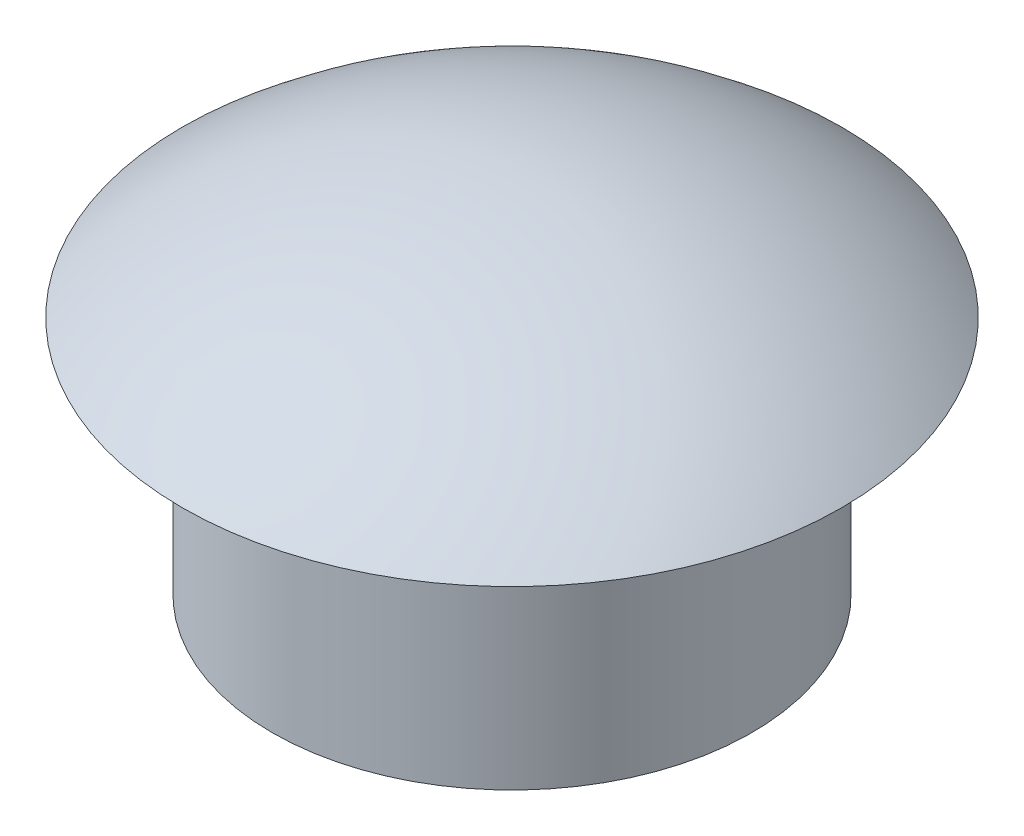
ISO-10303-21;
HEADER;
FILE_DESCRIPTION(('STEP AP214'),'2;1');
FILE_NAME('part.step','',(''),(''),'','','');
FILE_SCHEMA(('AUTOMOTIVE_DESIGN { 1 0 10303 214 1 1 1 1 }'));
ENDSEC;
DATA;
#1=APPLICATION_CONTEXT('core data for automotive mechanical design processes');
#2=APPLICATION_PROTOCOL_DEFINITION('international standard','automotive_design',2000,#1);
#3=PRODUCT_CONTEXT('',#1,'mechanical');
#4=PRODUCT('Part','Part','',(#3));
#5=PRODUCT_RELATED_PRODUCT_CATEGORY('part','',(#4));
#6=PRODUCT_DEFINITION_FORMATION('','',#4);
#7=PRODUCT_DEFINITION_CONTEXT('part definition',#1,'design');
#8=PRODUCT_DEFINITION('design','',#6,#7);
#9=PRODUCT_DEFINITION_SHAPE('','',#8);
#10=(LENGTH_UNIT() NAMED_UNIT(*) SI_UNIT(.MILLI.,.METRE.));
#11=(NAMED_UNIT(*) PLANE_ANGLE_UNIT() SI_UNIT($,.RADIAN.));
#12=(NAMED_UNIT(*) SI_UNIT($,.STERADIAN.) SOLID_ANGLE_UNIT());
#13=UNCERTAINTY_MEASURE_WITH_UNIT(LENGTH_MEASURE(1.E-05),#10,'distance_accuracy_value','');
#14=(GEOMETRIC_REPRESENTATION_CONTEXT(3) GLOBAL_UNCERTAINTY_ASSIGNED_CONTEXT((#13)) GLOBAL_UNIT_ASSIGNED_CONTEXT((#10,
#11,#12)) REPRESENTATION_CONTEXT('',''));
#15=CARTESIAN_POINT('',(0.,0.,0.));
#16=DIRECTION('',(0.,0.,1.));
#17=DIRECTION('',(1.,0.,0.));
#18=AXIS2_PLACEMENT_3D('',#15,#16,#17);
#19=CARTESIAN_POINT('',(0.,6.35,0.));
#20=DIRECTION('',(0.,1.,0.));
#21=DIRECTION('',(-1.,0.,0.));
#22=AXIS2_PLACEMENT_3D('',#19,#20,#21);
#23=PLANE('',#22);
#24=CARTESIAN_POINT('',(0.,6.35,0.));
#25=DIRECTION('',(0.,1.,0.));
#26=DIRECTION('',(-1.,0.,0.));
#27=AXIS2_PLACEMENT_3D('',#24,#25,#26);
#28=CIRCLE('',#27,4.7625);
#29=CARTESIAN_POINT('',(-4.7625,6.35,0.));
#30=VERTEX_POINT('',#29);
#31=EDGE_CURVE('E53',#30,#30,#28,.T.);
#32=ORIENTED_EDGE('',*,*,#31,.F.);
#33=EDGE_LOOP('',(#32));
#34=FACE_BOUND('',#33,.T.);
#35=CARTESIAN_POINT('',(-3.862295552,6.35,0.));
#36=DIRECTION('',(0.,1.,0.));
#37=DIRECTION('',(0.,0.,-1.));
#38=AXIS2_PLACEMENT_3D('',#35,#36,#37);
#39=CIRCLE('',#38,0.79375);
#40=CARTESIAN_POINT('',(-4.656045552,6.35,0.));
#41=VERTEX_POINT('',#40);
#42=EDGE_CURVE('E47',#41,#41,#39,.T.);
#43=ORIENTED_EDGE('',*,*,#42,.T.);
#44=EDGE_LOOP('',(#43));
#45=FACE_BOUND('',#44,.T.);
#46=CARTESIAN_POINT('',(3.862295552,6.35,0.));
#47=DIRECTION('',(0.,-1.,0.));
#48=DIRECTION('',(0.,0.,-1.));
#49=AXIS2_PLACEMENT_3D('',#46,#47,#48);
#50=CIRCLE('',#49,0.79375);
#51=CARTESIAN_POINT('',(4.656045552,6.35,0.));
#52=VERTEX_POINT('',#51);
#53=EDGE_CURVE('E10',#52,#52,#50,.T.);
#54=ORIENTED_EDGE('',*,*,#53,.F.);
#55=EDGE_LOOP('',(#54));
#56=FACE_BOUND('',#55,.T.);
#57=ADVANCED_FACE('F33',(#34,#45,#56),#23,.F.);
#58=CARTESIAN_POINT('',(0.,0.,0.));
#59=DIRECTION('',(0.,1.,0.));
#60=DIRECTION('',(0.,0.,1.));
#61=AXIS2_PLACEMENT_3D('',#58,#59,#60);
#62=PLANE('',#61);
#63=CARTESIAN_POINT('',(0.,0.,0.));
#64=DIRECTION('',(0.,1.,0.));
#65=DIRECTION('',(0.,0.,1.));
#66=AXIS2_PLACEMENT_3D('',#63,#64,#65);
#67=CIRCLE('',#66,6.35);
#68=CARTESIAN_POINT('',(0.,0.,6.35));
#69=VERTEX_POINT('',#68);
#70=EDGE_CURVE('E37',#69,#69,#67,.T.);
#71=ORIENTED_EDGE('',*,*,#70,.F.);
#72=EDGE_LOOP('',(#71));
#73=FACE_BOUND('',#72,.T.);
#74=CARTESIAN_POINT('',(0.,0.,0.));
#75=DIRECTION('',(0.,1.,0.));
#76=DIRECTION('',(0.,0.,1.));
#77=AXIS2_PLACEMENT_3D('',#74,#75,#76);
#78=CIRCLE('',#77,4.7625);
#79=CARTESIAN_POINT('',(0.,0.,4.7625));
#80=VERTEX_POINT('',#79);
#81=EDGE_CURVE('E56',#80,#80,#78,.T.);
#82=ORIENTED_EDGE('',*,*,#81,.T.);
#83=EDGE_LOOP('',(#82));
#84=FACE_BOUND('',#83,.T.);
#85=ADVANCED_FACE('F64',(#73,#84),#62,.F.);
#86=CARTESIAN_POINT('',(0.,6.35,0.));
#87=DIRECTION('',(0.,-1.,0.));
#88=DIRECTION('',(0.,0.,-1.));
#89=AXIS2_PLACEMENT_3D('',#86,#87,#88);
#90=CYLINDRICAL_SURFACE('',#89,6.35);
#91=CARTESIAN_POINT('',(0.,6.35,0.));
#92=DIRECTION('',(0.,1.,0.));
#93=DIRECTION('',(0.,0.,1.));
#94=AXIS2_PLACEMENT_3D('',#91,#92,#93);
#95=CIRCLE('',#94,6.35);
#96=CARTESIAN_POINT('',(0.,6.35,6.35));
#97=VERTEX_POINT('',#96);
#98=EDGE_CURVE('E41',#97,#97,#95,.T.);
#99=ORIENTED_EDGE('',*,*,#98,.F.);
#100=EDGE_LOOP('',(#99));
#101=FACE_BOUND('',#100,.T.);
#102=ORIENTED_EDGE('',*,*,#70,.T.);
#103=EDGE_LOOP('',(#102));
#104=FACE_BOUND('',#103,.T.);
#105=ADVANCED_FACE('F35',(#101,#104),#90,.T.);
#106=CARTESIAN_POINT('',(0.,6.35,0.));
#107=DIRECTION('',(0.,-1.,0.));
#108=DIRECTION('',(0.,0.,-1.));
#109=AXIS2_PLACEMENT_3D('',#106,#107,#108);
#110=CYLINDRICAL_SURFACE('',#109,4.7625);
#111=ORIENTED_EDGE('',*,*,#31,.T.);
#112=EDGE_LOOP('',(#111));
#113=FACE_BOUND('',#112,.T.);
#114=ORIENTED_EDGE('',*,*,#81,.F.);
#115=EDGE_LOOP('',(#114));
#116=FACE_BOUND('',#115,.T.);
#117=ADVANCED_FACE('F70',(#113,#116),#110,.F.);
#118=CARTESIAN_POINT('',(0.,-4.06796875,0.));
#119=DIRECTION('',(0.,1.,0.));
#120=DIRECTION('',(1.,0.,0.));
#121=AXIS2_PLACEMENT_3D('',#118,#119,#120);
#122=SPHERICAL_SURFACE('',#121,13.59296875);
#123=CARTESIAN_POINT('',(0.,6.35,0.));
#124=DIRECTION('',(0.,1.,0.));
#125=DIRECTION('',(-1.,0.,0.));
#126=AXIS2_PLACEMENT_3D('',#123,#124,#125);
#127=CIRCLE('',#126,8.73125);
#128=CARTESIAN_POINT('',(-8.73125,6.35,0.));
#129=VERTEX_POINT('',#128);
#130=EDGE_CURVE('E50',#129,#129,#127,.T.);
#131=ORIENTED_EDGE('',*,*,#130,.T.);
#132=EDGE_LOOP('',(#131));
#133=FACE_BOUND('',#132,.T.);
#134=ADVANCED_FACE('F78',(#133),#122,.T.);
#135=ORIENTED_EDGE('',*,*,#98,.T.);
#136=EDGE_LOOP('',(#135));
#137=FACE_BOUND('',#136,.T.);
#138=ORIENTED_EDGE('',*,*,#130,.F.);
#139=EDGE_LOOP('',(#138));
#140=FACE_BOUND('',#139,.T.);
#141=ADVANCED_FACE('F74',(#137,#140),#23,.F.);
#142=CARTESIAN_POINT('',(0.,6.35,0.));
#143=DIRECTION('',(0.,0.,-1.));
#144=DIRECTION('',(-1.,0.,0.));
#145=AXIS2_PLACEMENT_3D('',#142,#143,#144);
#146=TOROIDAL_SURFACE('',#145,3.862295552,0.79375);
#147=CARTESIAN_POINT('',(0.,6.35,0.));
#148=DIRECTION('',(0.,0.,-1.));
#149=DIRECTION('',(-1.,0.,0.));
#150=AXIS2_PLACEMENT_3D('',#147,#148,#149);
#151=CIRCLE('',#150,4.656045552);
#152=EDGE_CURVE('',#52,#41,#151,.T.);
#153=ORIENTED_EDGE('',*,*,#53,.T.);
#154=ORIENTED_EDGE('',*,*,#42,.F.);
#155=ORIENTED_EDGE('',*,*,#152,.T.);
#156=ORIENTED_EDGE('',*,*,#152,.F.);
#157=EDGE_LOOP('',(#153,#155,#154,#156));
#158=FACE_BOUND('',#157,.T.);
#159=ADVANCED_FACE('F84',(#158),#146,.T.);
#160=CLOSED_SHELL('',(#57,#85,#105,#117,#134,#141,#159));
#161=MANIFOLD_SOLID_BREP('B2',#160);
#162=ADVANCED_BREP_SHAPE_REPRESENTATION('',(#18,#161),#14);
#163=SHAPE_DEFINITION_REPRESENTATION(#9,#162);
ENDSEC;
END-ISO-10303-21;
